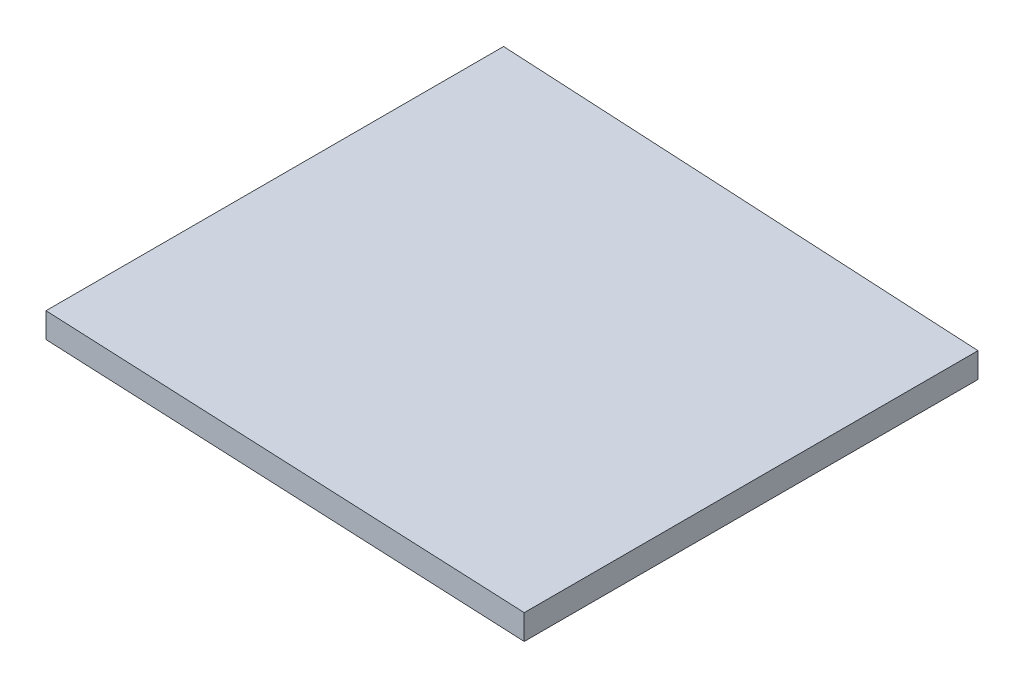
ISO-10303-21;
HEADER;
FILE_DESCRIPTION(('STEP AP214'),'2;1');
FILE_NAME('part.step','',(''),(''),'','','');
FILE_SCHEMA(('AUTOMOTIVE_DESIGN { 1 0 10303 214 1 1 1 1 }'));
ENDSEC;
DATA;
#1=APPLICATION_CONTEXT('core data for automotive mechanical design processes');
#2=APPLICATION_PROTOCOL_DEFINITION('international standard','automotive_design',2000,#1);
#3=PRODUCT_CONTEXT('',#1,'mechanical');
#4=PRODUCT('Part','Part','',(#3));
#5=PRODUCT_RELATED_PRODUCT_CATEGORY('part','',(#4));
#6=PRODUCT_DEFINITION_FORMATION('','',#4);
#7=PRODUCT_DEFINITION_CONTEXT('part definition',#1,'design');
#8=PRODUCT_DEFINITION('design','',#6,#7);
#9=PRODUCT_DEFINITION_SHAPE('','',#8);
#10=(LENGTH_UNIT() NAMED_UNIT(*) SI_UNIT(.MILLI.,.METRE.));
#11=(NAMED_UNIT(*) PLANE_ANGLE_UNIT() SI_UNIT($,.RADIAN.));
#12=(NAMED_UNIT(*) SI_UNIT($,.STERADIAN.) SOLID_ANGLE_UNIT());
#13=UNCERTAINTY_MEASURE_WITH_UNIT(LENGTH_MEASURE(1.E-05),#10,'distance_accuracy_value','');
#14=(GEOMETRIC_REPRESENTATION_CONTEXT(3) GLOBAL_UNCERTAINTY_ASSIGNED_CONTEXT((#13)) GLOBAL_UNIT_ASSIGNED_CONTEXT((#10,
#11,#12)) REPRESENTATION_CONTEXT('',''));
#15=CARTESIAN_POINT('',(0.,0.,0.));
#16=DIRECTION('',(0.,0.,1.));
#17=DIRECTION('',(1.,0.,0.));
#18=AXIS2_PLACEMENT_3D('',#15,#16,#17);
#19=CARTESIAN_POINT('',(0.,2.,0.));
#20=DIRECTION('',(0.0446747138443855,0.,-0.999001586556759));
#21=DIRECTION('',(-0.999001586556759,0.,-0.0446747138443855));
#22=AXIS2_PLACEMENT_3D('',#19,#20,#21);
#23=PLANE('',#22);
#24=DIRECTION('',(0.999001586556759,0.,0.0446747138443855));
#25=VECTOR('',#24,1.);
#26=CARTESIAN_POINT('',(0.,0.,0.));
#27=LINE('',#26,#25);
#28=CARTESIAN_POINT('',(0.,0.,0.));
#29=VERTEX_POINT('',#28);
#30=CARTESIAN_POINT('',(40.0548938399168,0.,1.79122930778634));
#31=VERTEX_POINT('',#30);
#32=EDGE_CURVE('E107',#29,#31,#27,.T.);
#33=ORIENTED_EDGE('',*,*,#32,.T.);
#34=DIRECTION('',(0.,-1.,0.));
#35=VECTOR('',#34,1.);
#36=CARTESIAN_POINT('',(40.0548938399168,2.,1.79122930778634));
#37=LINE('',#36,#35);
#38=CARTESIAN_POINT('',(40.0548938399168,2.,1.79122930778634));
#39=VERTEX_POINT('',#38);
#40=EDGE_CURVE('E11',#39,#31,#37,.T.);
#41=ORIENTED_EDGE('',*,*,#40,.F.);
#42=DIRECTION('',(0.999001586556759,0.,0.0446747138443855));
#43=VECTOR('',#42,1.);
#44=CARTESIAN_POINT('',(0.,2.,0.));
#45=LINE('',#44,#43);
#46=CARTESIAN_POINT('',(0.,2.,0.));
#47=VERTEX_POINT('',#46);
#48=EDGE_CURVE('E91',#47,#39,#45,.T.);
#49=ORIENTED_EDGE('',*,*,#48,.F.);
#50=DIRECTION('',(0.,-1.,0.));
#51=VECTOR('',#50,1.);
#52=CARTESIAN_POINT('',(0.,2.,0.));
#53=LINE('',#52,#51);
#54=EDGE_CURVE('E103',#47,#29,#53,.T.);
#55=ORIENTED_EDGE('',*,*,#54,.T.);
#56=EDGE_LOOP('',(#33,#41,#49,#55));
#57=FACE_BOUND('',#56,.T.);
#58=ADVANCED_FACE('F39',(#57),#23,.F.);
#59=CARTESIAN_POINT('',(40.0548938399168,2.,1.79122930778634));
#60=DIRECTION('',(-1.,0.,0.));
#61=DIRECTION('',(0.,0.,1.));
#62=AXIS2_PLACEMENT_3D('',#59,#60,#61);
#63=PLANE('',#62);
#64=DIRECTION('',(0.,0.,-1.));
#65=VECTOR('',#64,1.);
#66=CARTESIAN_POINT('',(40.0548938399168,0.,1.79122930778634));
#67=LINE('',#66,#65);
#68=CARTESIAN_POINT('',(40.0548938399168,0.,-34.5164134601551));
#69=VERTEX_POINT('',#68);
#70=EDGE_CURVE('E96',#31,#69,#67,.T.);
#71=ORIENTED_EDGE('',*,*,#70,.T.);
#72=DIRECTION('',(0.,-1.,0.));
#73=VECTOR('',#72,1.);
#74=CARTESIAN_POINT('',(40.0548938399168,2.,-34.5164134601551));
#75=LINE('',#74,#73);
#76=CARTESIAN_POINT('',(40.0548938399168,2.,-34.5164134601551));
#77=VERTEX_POINT('',#76);
#78=EDGE_CURVE('E48',#77,#69,#75,.T.);
#79=ORIENTED_EDGE('',*,*,#78,.F.);
#80=DIRECTION('',(0.,0.,-1.));
#81=VECTOR('',#80,1.);
#82=CARTESIAN_POINT('',(40.0548938399168,2.,1.79122930778634));
#83=LINE('',#82,#81);
#84=EDGE_CURVE('E86',#39,#77,#83,.T.);
#85=ORIENTED_EDGE('',*,*,#84,.F.);
#86=ORIENTED_EDGE('',*,*,#40,.T.);
#87=EDGE_LOOP('',(#71,#79,#85,#86));
#88=FACE_BOUND('',#87,.T.);
#89=ADVANCED_FACE('F95',(#88),#63,.F.);
#90=CARTESIAN_POINT('',(40.0548938399168,2.,-34.5164134601551));
#91=DIRECTION('',(-0.0522644276887151,0.,0.998633280838552));
#92=DIRECTION('',(0.998633280838553,0.,0.0522644276887151));
#93=AXIS2_PLACEMENT_3D('',#90,#91,#92);
#94=PLANE('',#93);
#95=DIRECTION('',(-0.998633280838553,0.,-0.0522644276887151));
#96=VECTOR('',#95,1.);
#97=CARTESIAN_POINT('',(40.0548938399168,0.,-34.5164134601551));
#98=LINE('',#97,#96);
#99=CARTESIAN_POINT('',(0.,0.,-36.6127246314767));
#100=VERTEX_POINT('',#99);
#101=EDGE_CURVE('E73',#69,#100,#98,.T.);
#102=ORIENTED_EDGE('',*,*,#101,.T.);
#103=DIRECTION('',(0.,-1.,0.));
#104=VECTOR('',#103,1.);
#105=CARTESIAN_POINT('',(0.,2.,-36.6127246314767));
#106=LINE('',#105,#104);
#107=CARTESIAN_POINT('',(0.,2.,-36.6127246314767));
#108=VERTEX_POINT('',#107);
#109=EDGE_CURVE('E98',#108,#100,#106,.T.);
#110=ORIENTED_EDGE('',*,*,#109,.F.);
#111=DIRECTION('',(-0.998633280838553,0.,-0.0522644276887151));
#112=VECTOR('',#111,1.);
#113=CARTESIAN_POINT('',(40.0548938399168,2.,-34.5164134601551));
#114=LINE('',#113,#112);
#115=EDGE_CURVE('E89',#77,#108,#114,.T.);
#116=ORIENTED_EDGE('',*,*,#115,.F.);
#117=ORIENTED_EDGE('',*,*,#78,.T.);
#118=EDGE_LOOP('',(#102,#110,#116,#117));
#119=FACE_BOUND('',#118,.T.);
#120=ADVANCED_FACE('F99',(#119),#94,.F.);
#121=CARTESIAN_POINT('',(0.,2.,-36.6127246314767));
#122=DIRECTION('',(1.,0.,0.));
#123=DIRECTION('',(0.,0.,-1.));
#124=AXIS2_PLACEMENT_3D('',#121,#122,#123);
#125=PLANE('',#124);
#126=DIRECTION('',(0.,0.,1.));
#127=VECTOR('',#126,1.);
#128=CARTESIAN_POINT('',(0.,0.,-36.6127246314767));
#129=LINE('',#128,#127);
#130=EDGE_CURVE('E79',#100,#29,#129,.T.);
#131=ORIENTED_EDGE('',*,*,#130,.T.);
#132=ORIENTED_EDGE('',*,*,#54,.F.);
#133=DIRECTION('',(0.,0.,1.));
#134=VECTOR('',#133,1.);
#135=CARTESIAN_POINT('',(0.,2.,-36.6127246314767));
#136=LINE('',#135,#134);
#137=EDGE_CURVE('E56',#108,#47,#136,.T.);
#138=ORIENTED_EDGE('',*,*,#137,.F.);
#139=ORIENTED_EDGE('',*,*,#109,.T.);
#140=EDGE_LOOP('',(#131,#132,#138,#139));
#141=FACE_BOUND('',#140,.T.);
#142=ADVANCED_FACE('F120',(#141),#125,.F.);
#143=CARTESIAN_POINT('',(0.,2.,0.));
#144=DIRECTION('',(0.,1.,0.));
#145=DIRECTION('',(0.,0.,1.));
#146=AXIS2_PLACEMENT_3D('',#143,#144,#145);
#147=PLANE('',#146);
#148=ORIENTED_EDGE('',*,*,#48,.T.);
#149=ORIENTED_EDGE('',*,*,#84,.T.);
#150=ORIENTED_EDGE('',*,*,#115,.T.);
#151=ORIENTED_EDGE('',*,*,#137,.T.);
#152=EDGE_LOOP('',(#148,#149,#150,#151));
#153=FACE_BOUND('',#152,.T.);
#154=ADVANCED_FACE('F87',(#153),#147,.T.);
#155=CARTESIAN_POINT('',(0.,0.,0.));
#156=DIRECTION('',(0.,1.,0.));
#157=DIRECTION('',(0.,0.,1.));
#158=AXIS2_PLACEMENT_3D('',#155,#156,#157);
#159=PLANE('',#158);
#160=ORIENTED_EDGE('',*,*,#32,.F.);
#161=ORIENTED_EDGE('',*,*,#130,.F.);
#162=ORIENTED_EDGE('',*,*,#101,.F.);
#163=ORIENTED_EDGE('',*,*,#70,.F.);
#164=EDGE_LOOP('',(#160,#161,#162,#163));
#165=FACE_BOUND('',#164,.T.);
#166=ADVANCED_FACE('F123',(#165),#159,.F.);
#167=CLOSED_SHELL('',(#58,#89,#120,#142,#154,#166));
#168=MANIFOLD_SOLID_BREP('B2',#167);
#169=ADVANCED_BREP_SHAPE_REPRESENTATION('',(#18,#168),#14);
#170=SHAPE_DEFINITION_REPRESENTATION(#9,#169);
ENDSEC;
END-ISO-10303-21;
